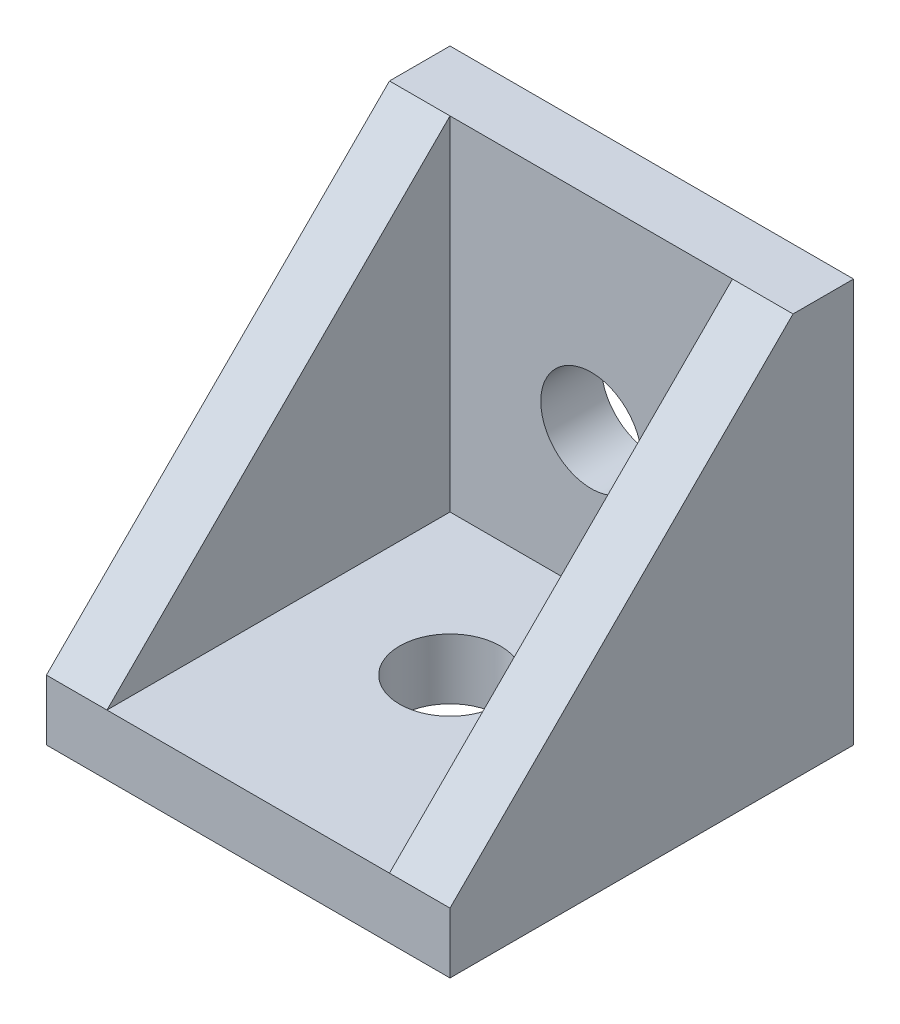
ISO-10303-21;
HEADER;
FILE_DESCRIPTION(('STEP AP214'),'2;1');
FILE_NAME('part.step','',(''),(''),'','','');
FILE_SCHEMA(('AUTOMOTIVE_DESIGN { 1 0 10303 214 1 1 1 1 }'));
ENDSEC;
DATA;
#1=APPLICATION_CONTEXT('core data for automotive mechanical design processes');
#2=APPLICATION_PROTOCOL_DEFINITION('international standard','automotive_design',2000,#1);
#3=PRODUCT_CONTEXT('',#1,'mechanical');
#4=PRODUCT('Part','Part','',(#3));
#5=PRODUCT_RELATED_PRODUCT_CATEGORY('part','',(#4));
#6=PRODUCT_DEFINITION_FORMATION('','',#4);
#7=PRODUCT_DEFINITION_CONTEXT('part definition',#1,'design');
#8=PRODUCT_DEFINITION('design','',#6,#7);
#9=PRODUCT_DEFINITION_SHAPE('','',#8);
#10=(LENGTH_UNIT() NAMED_UNIT(*) SI_UNIT(.MILLI.,.METRE.));
#11=(NAMED_UNIT(*) PLANE_ANGLE_UNIT() SI_UNIT($,.RADIAN.));
#12=(NAMED_UNIT(*) SI_UNIT($,.STERADIAN.) SOLID_ANGLE_UNIT());
#13=UNCERTAINTY_MEASURE_WITH_UNIT(LENGTH_MEASURE(1.E-05),#10,'distance_accuracy_value','');
#14=(GEOMETRIC_REPRESENTATION_CONTEXT(3) GLOBAL_UNCERTAINTY_ASSIGNED_CONTEXT((#13)) GLOBAL_UNIT_ASSIGNED_CONTEXT((#10,
#11,#12)) REPRESENTATION_CONTEXT('',''));
#15=CARTESIAN_POINT('',(0.,0.,0.));
#16=DIRECTION('',(0.,0.,1.));
#17=DIRECTION('',(1.,0.,0.));
#18=AXIS2_PLACEMENT_3D('',#15,#16,#17);
#19=CARTESIAN_POINT('',(-10.,0.,10.));
#20=DIRECTION('',(0.,1.,0.));
#21=DIRECTION('',(1.,0.,0.));
#22=AXIS2_PLACEMENT_3D('',#19,#20,#21);
#23=PLANE('',#22);
#24=CARTESIAN_POINT('',(-10.,0.,10.));
#25=DIRECTION('',(0.,-1.,0.));
#26=DIRECTION('',(1.,0.,0.));
#27=AXIS2_PLACEMENT_3D('',#24,#25,#26);
#28=CIRCLE('',#27,2.5);
#29=CARTESIAN_POINT('',(-12.5,0.,10.));
#30=VERTEX_POINT('',#29);
#31=EDGE_CURVE('E28',#30,#30,#28,.T.);
#32=ORIENTED_EDGE('',*,*,#31,.F.);
#33=EDGE_LOOP('',(#32));
#34=FACE_BOUND('',#33,.T.);
#35=DIRECTION('',(0.,0.,-1.));
#36=VECTOR('',#35,1.);
#37=CARTESIAN_POINT('',(0.,0.,20.));
#38=LINE('',#37,#36);
#39=CARTESIAN_POINT('',(0.,0.,20.));
#40=VERTEX_POINT('',#39);
#41=CARTESIAN_POINT('',(0.,0.,0.));
#42=VERTEX_POINT('',#41);
#43=EDGE_CURVE('E144',#40,#42,#38,.T.);
#44=ORIENTED_EDGE('',*,*,#43,.F.);
#45=DIRECTION('',(1.,0.,0.));
#46=VECTOR('',#45,1.);
#47=CARTESIAN_POINT('',(-20.,0.,20.));
#48=LINE('',#47,#46);
#49=CARTESIAN_POINT('',(-20.,0.,20.));
#50=VERTEX_POINT('',#49);
#51=EDGE_CURVE('E201',#50,#40,#48,.T.);
#52=ORIENTED_EDGE('',*,*,#51,.F.);
#53=DIRECTION('',(0.,0.,1.));
#54=VECTOR('',#53,1.);
#55=CARTESIAN_POINT('',(-20.,0.,0.));
#56=LINE('',#55,#54);
#57=CARTESIAN_POINT('',(-20.,0.,0.));
#58=VERTEX_POINT('',#57);
#59=EDGE_CURVE('E177',#58,#50,#56,.T.);
#60=ORIENTED_EDGE('',*,*,#59,.F.);
#61=DIRECTION('',(-1.,0.,0.));
#62=VECTOR('',#61,1.);
#63=CARTESIAN_POINT('',(0.,0.,0.));
#64=LINE('',#63,#62);
#65=EDGE_CURVE('E11',#42,#58,#64,.T.);
#66=ORIENTED_EDGE('',*,*,#65,.F.);
#67=EDGE_LOOP('',(#44,#52,#60,#66));
#68=FACE_BOUND('',#67,.T.);
#69=ADVANCED_FACE('F17',(#34,#68),#23,.F.);
#70=CARTESIAN_POINT('',(0.,0.,0.));
#71=DIRECTION('',(0.,0.,-1.));
#72=DIRECTION('',(0.,-1.,0.));
#73=AXIS2_PLACEMENT_3D('',#70,#71,#72);
#74=PLANE('',#73);
#75=CARTESIAN_POINT('',(-10.,10.,0.));
#76=DIRECTION('',(0.,0.,1.));
#77=DIRECTION('',(1.,0.,0.));
#78=AXIS2_PLACEMENT_3D('',#75,#76,#77);
#79=CIRCLE('',#78,2.5);
#80=CARTESIAN_POINT('',(-12.5,10.,0.));
#81=VERTEX_POINT('',#80);
#82=EDGE_CURVE('E249',#81,#81,#79,.T.);
#83=ORIENTED_EDGE('',*,*,#82,.T.);
#84=EDGE_LOOP('',(#83));
#85=FACE_BOUND('',#84,.T.);
#86=ORIENTED_EDGE('',*,*,#65,.T.);
#87=DIRECTION('',(0.,1.,0.));
#88=VECTOR('',#87,1.);
#89=CARTESIAN_POINT('',(-20.,0.,0.));
#90=LINE('',#89,#88);
#91=CARTESIAN_POINT('',(-20.,20.,0.));
#92=VERTEX_POINT('',#91);
#93=EDGE_CURVE('E154',#58,#92,#90,.T.);
#94=ORIENTED_EDGE('',*,*,#93,.T.);
#95=DIRECTION('',(-1.,0.,0.));
#96=VECTOR('',#95,1.);
#97=CARTESIAN_POINT('',(0.,20.,0.));
#98=LINE('',#97,#96);
#99=CARTESIAN_POINT('',(0.,20.,0.));
#100=VERTEX_POINT('',#99);
#101=EDGE_CURVE('E151',#100,#92,#98,.T.);
#102=ORIENTED_EDGE('',*,*,#101,.F.);
#103=DIRECTION('',(0.,1.,0.));
#104=VECTOR('',#103,1.);
#105=CARTESIAN_POINT('',(0.,0.,0.));
#106=LINE('',#105,#104);
#107=EDGE_CURVE('E136',#42,#100,#106,.T.);
#108=ORIENTED_EDGE('',*,*,#107,.F.);
#109=EDGE_LOOP('',(#86,#94,#102,#108));
#110=FACE_BOUND('',#109,.T.);
#111=ADVANCED_FACE('F152',(#85,#110),#74,.T.);
#112=CARTESIAN_POINT('',(-10.,0.,10.));
#113=DIRECTION('',(0.,1.,0.));
#114=DIRECTION('',(1.,0.,0.));
#115=AXIS2_PLACEMENT_3D('',#112,#113,#114);
#116=CYLINDRICAL_SURFACE('',#115,2.5);
#117=CARTESIAN_POINT('',(-10.,3.,10.));
#118=DIRECTION('',(0.,1.,0.));
#119=DIRECTION('',(1.,0.,0.));
#120=AXIS2_PLACEMENT_3D('',#117,#118,#119);
#121=CIRCLE('',#120,2.5);
#122=CARTESIAN_POINT('',(-7.5,3.,10.));
#123=VERTEX_POINT('',#122);
#124=CARTESIAN_POINT('',(-12.5,3.,10.));
#125=VERTEX_POINT('',#124);
#126=EDGE_CURVE('E193',#123,#125,#121,.T.);
#127=ORIENTED_EDGE('',*,*,#126,.T.);
#128=DIRECTION('',(0.,-1.,0.));
#129=VECTOR('',#128,1.);
#130=CARTESIAN_POINT('',(-12.5,0.,10.));
#131=LINE('',#130,#129);
#132=EDGE_CURVE('E235',#125,#30,#131,.T.);
#133=ORIENTED_EDGE('',*,*,#132,.T.);
#134=ORIENTED_EDGE('',*,*,#31,.T.);
#135=ORIENTED_EDGE('',*,*,#132,.F.);
#136=CARTESIAN_POINT('',(-10.,3.,10.));
#137=DIRECTION('',(0.,1.,0.));
#138=DIRECTION('',(1.,0.,0.));
#139=AXIS2_PLACEMENT_3D('',#136,#137,#138);
#140=CIRCLE('',#139,2.5);
#141=EDGE_CURVE('E204',#125,#123,#140,.T.);
#142=ORIENTED_EDGE('',*,*,#141,.T.);
#143=EDGE_LOOP('',(#127,#133,#134,#135,#142));
#144=FACE_BOUND('',#143,.T.);
#145=ADVANCED_FACE('F285',(#144),#116,.F.);
#146=CARTESIAN_POINT('',(-10.,10.,20.));
#147=DIRECTION('',(0.,0.,-1.));
#148=DIRECTION('',(1.,0.,0.));
#149=AXIS2_PLACEMENT_3D('',#146,#147,#148);
#150=CYLINDRICAL_SURFACE('',#149,2.5);
#151=CARTESIAN_POINT('',(-10.,10.,3.));
#152=DIRECTION('',(0.,0.,1.));
#153=DIRECTION('',(1.,0.,0.));
#154=AXIS2_PLACEMENT_3D('',#151,#152,#153);
#155=CIRCLE('',#154,2.5);
#156=CARTESIAN_POINT('',(-12.5,10.,3.));
#157=VERTEX_POINT('',#156);
#158=EDGE_CURVE('E21',#157,#157,#155,.T.);
#159=ORIENTED_EDGE('',*,*,#158,.T.);
#160=DIRECTION('',(0.,0.,-1.));
#161=VECTOR('',#160,1.);
#162=CARTESIAN_POINT('',(-12.5,10.,20.));
#163=LINE('',#162,#161);
#164=EDGE_CURVE('E203',#157,#81,#163,.T.);
#165=ORIENTED_EDGE('',*,*,#164,.T.);
#166=ORIENTED_EDGE('',*,*,#82,.F.);
#167=ORIENTED_EDGE('',*,*,#164,.F.);
#168=EDGE_LOOP('',(#159,#165,#166,#167));
#169=FACE_BOUND('',#168,.T.);
#170=ADVANCED_FACE('F19',(#169),#150,.F.);
#171=CARTESIAN_POINT('',(-20.,0.,20.));
#172=DIRECTION('',(0.,0.,1.));
#173=DIRECTION('',(1.,0.,0.));
#174=AXIS2_PLACEMENT_3D('',#171,#172,#173);
#175=PLANE('',#174);
#176=DIRECTION('',(-1.,0.,0.));
#177=VECTOR('',#176,1.);
#178=CARTESIAN_POINT('',(-20.,3.,20.));
#179=LINE('',#178,#177);
#180=CARTESIAN_POINT('',(-17.,3.,20.));
#181=VERTEX_POINT('',#180);
#182=CARTESIAN_POINT('',(-20.,3.,20.));
#183=VERTEX_POINT('',#182);
#184=EDGE_CURVE('E194',#181,#183,#179,.T.);
#185=ORIENTED_EDGE('',*,*,#184,.T.);
#186=DIRECTION('',(0.,1.,0.));
#187=VECTOR('',#186,1.);
#188=CARTESIAN_POINT('',(-20.,0.,20.));
#189=LINE('',#188,#187);
#190=EDGE_CURVE('E181',#50,#183,#189,.T.);
#191=ORIENTED_EDGE('',*,*,#190,.F.);
#192=ORIENTED_EDGE('',*,*,#51,.T.);
#193=DIRECTION('',(0.,1.,0.));
#194=VECTOR('',#193,1.);
#195=CARTESIAN_POINT('',(0.,0.,20.));
#196=LINE('',#195,#194);
#197=CARTESIAN_POINT('',(0.,3.,20.));
#198=VERTEX_POINT('',#197);
#199=EDGE_CURVE('E158',#40,#198,#196,.T.);
#200=ORIENTED_EDGE('',*,*,#199,.T.);
#201=DIRECTION('',(-1.,0.,0.));
#202=VECTOR('',#201,1.);
#203=CARTESIAN_POINT('',(-20.,3.,20.));
#204=LINE('',#203,#202);
#205=CARTESIAN_POINT('',(-3.,3.,20.));
#206=VERTEX_POINT('',#205);
#207=EDGE_CURVE('E175',#198,#206,#204,.T.);
#208=ORIENTED_EDGE('',*,*,#207,.T.);
#209=DIRECTION('',(-1.,0.,0.));
#210=VECTOR('',#209,1.);
#211=CARTESIAN_POINT('',(-15.,3.,20.));
#212=LINE('',#211,#210);
#213=EDGE_CURVE('E58',#206,#181,#212,.T.);
#214=ORIENTED_EDGE('',*,*,#213,.T.);
#215=EDGE_LOOP('',(#185,#191,#192,#200,#208,#214));
#216=FACE_BOUND('',#215,.T.);
#217=ADVANCED_FACE('F274',(#216),#175,.T.);
#218=CARTESIAN_POINT('',(-10.,3.,11.5));
#219=DIRECTION('',(0.,1.,0.));
#220=DIRECTION('',(1.,0.,0.));
#221=AXIS2_PLACEMENT_3D('',#218,#219,#220);
#222=PLANE('',#221);
#223=ORIENTED_EDGE('',*,*,#126,.F.);
#224=ORIENTED_EDGE('',*,*,#141,.F.);
#225=EDGE_LOOP('',(#223,#224));
#226=FACE_BOUND('',#225,.T.);
#227=ORIENTED_EDGE('',*,*,#213,.F.);
#228=DIRECTION('',(0.,0.,1.));
#229=VECTOR('',#228,1.);
#230=CARTESIAN_POINT('',(-3.,3.,20.));
#231=LINE('',#230,#229);
#232=CARTESIAN_POINT('',(-3.,3.,3.));
#233=VERTEX_POINT('',#232);
#234=EDGE_CURVE('E223',#233,#206,#231,.T.);
#235=ORIENTED_EDGE('',*,*,#234,.F.);
#236=DIRECTION('',(1.,0.,0.));
#237=VECTOR('',#236,1.);
#238=CARTESIAN_POINT('',(-3.,3.,3.));
#239=LINE('',#238,#237);
#240=CARTESIAN_POINT('',(-17.,3.,3.));
#241=VERTEX_POINT('',#240);
#242=EDGE_CURVE('E112',#241,#233,#239,.T.);
#243=ORIENTED_EDGE('',*,*,#242,.F.);
#244=DIRECTION('',(0.,0.,-1.));
#245=VECTOR('',#244,1.);
#246=CARTESIAN_POINT('',(-17.,3.,20.));
#247=LINE('',#246,#245);
#248=EDGE_CURVE('E219',#181,#241,#247,.T.);
#249=ORIENTED_EDGE('',*,*,#248,.F.);
#250=EDGE_LOOP('',(#227,#235,#243,#249));
#251=FACE_BOUND('',#250,.T.);
#252=ADVANCED_FACE('F265',(#226,#251),#222,.T.);
#253=CARTESIAN_POINT('',(-17.,20.,3.));
#254=DIRECTION('',(0.,0.,-1.));
#255=DIRECTION('',(0.,-1.,0.));
#256=AXIS2_PLACEMENT_3D('',#253,#254,#255);
#257=PLANE('',#256);
#258=ORIENTED_EDGE('',*,*,#158,.F.);
#259=EDGE_LOOP('',(#258));
#260=FACE_BOUND('',#259,.T.);
#261=DIRECTION('',(1.,0.,0.));
#262=VECTOR('',#261,1.);
#263=CARTESIAN_POINT('',(-13.5,20.,3.));
#264=LINE('',#263,#262);
#265=CARTESIAN_POINT('',(-17.,20.,3.));
#266=VERTEX_POINT('',#265);
#267=CARTESIAN_POINT('',(-3.,20.,3.));
#268=VERTEX_POINT('',#267);
#269=EDGE_CURVE('E74',#266,#268,#264,.T.);
#270=ORIENTED_EDGE('',*,*,#269,.F.);
#271=DIRECTION('',(0.,-1.,0.));
#272=VECTOR('',#271,1.);
#273=CARTESIAN_POINT('',(-17.,20.,3.));
#274=LINE('',#273,#272);
#275=EDGE_CURVE('E171',#266,#241,#274,.T.);
#276=ORIENTED_EDGE('',*,*,#275,.T.);
#277=ORIENTED_EDGE('',*,*,#242,.T.);
#278=DIRECTION('',(0.,-1.,0.));
#279=VECTOR('',#278,1.);
#280=CARTESIAN_POINT('',(-3.,20.,3.));
#281=LINE('',#280,#279);
#282=EDGE_CURVE('E147',#268,#233,#281,.T.);
#283=ORIENTED_EDGE('',*,*,#282,.F.);
#284=EDGE_LOOP('',(#270,#276,#277,#283));
#285=FACE_BOUND('',#284,.T.);
#286=ADVANCED_FACE('F262',(#260,#285),#257,.F.);
#287=CARTESIAN_POINT('',(-3.,20.,3.));
#288=DIRECTION('',(1.,0.,0.));
#289=DIRECTION('',(0.,1.,0.));
#290=AXIS2_PLACEMENT_3D('',#287,#288,#289);
#291=PLANE('',#290);
#292=DIRECTION('',(0.,0.707106781186548,-0.707106781186547));
#293=VECTOR('',#292,1.);
#294=CARTESIAN_POINT('',(-3.,11.5,11.5));
#295=LINE('',#294,#293);
#296=EDGE_CURVE('E184',#206,#268,#295,.T.);
#297=ORIENTED_EDGE('',*,*,#296,.T.);
#298=ORIENTED_EDGE('',*,*,#282,.T.);
#299=ORIENTED_EDGE('',*,*,#234,.T.);
#300=EDGE_LOOP('',(#297,#298,#299));
#301=FACE_BOUND('',#300,.T.);
#302=ADVANCED_FACE('F264',(#301),#291,.F.);
#303=CARTESIAN_POINT('',(0.,0.,20.));
#304=DIRECTION('',(1.,0.,0.));
#305=DIRECTION('',(0.,1.,0.));
#306=AXIS2_PLACEMENT_3D('',#303,#304,#305);
#307=PLANE('',#306);
#308=DIRECTION('',(0.,-0.707106781186548,0.707106781186547));
#309=VECTOR('',#308,1.);
#310=CARTESIAN_POINT('',(0.,2.25,20.75));
#311=LINE('',#310,#309);
#312=CARTESIAN_POINT('',(0.,20.,3.));
#313=VERTEX_POINT('',#312);
#314=EDGE_CURVE('E188',#313,#198,#311,.T.);
#315=ORIENTED_EDGE('',*,*,#314,.T.);
#316=ORIENTED_EDGE('',*,*,#199,.F.);
#317=ORIENTED_EDGE('',*,*,#43,.T.);
#318=ORIENTED_EDGE('',*,*,#107,.T.);
#319=DIRECTION('',(0.,0.,-1.));
#320=VECTOR('',#319,1.);
#321=CARTESIAN_POINT('',(0.,20.,20.));
#322=LINE('',#321,#320);
#323=EDGE_CURVE('E141',#313,#100,#322,.T.);
#324=ORIENTED_EDGE('',*,*,#323,.F.);
#325=EDGE_LOOP('',(#315,#316,#317,#318,#324));
#326=FACE_BOUND('',#325,.T.);
#327=ADVANCED_FACE('F139',(#326),#307,.T.);
#328=CARTESIAN_POINT('',(-10.,20.,10.));
#329=DIRECTION('',(0.,1.,0.));
#330=DIRECTION('',(1.,0.,0.));
#331=AXIS2_PLACEMENT_3D('',#328,#329,#330);
#332=PLANE('',#331);
#333=DIRECTION('',(1.,0.,0.));
#334=VECTOR('',#333,1.);
#335=CARTESIAN_POINT('',(-15.,20.,3.));
#336=LINE('',#335,#334);
#337=CARTESIAN_POINT('',(-20.,20.,3.));
#338=VERTEX_POINT('',#337);
#339=EDGE_CURVE('E228',#338,#266,#336,.T.);
#340=ORIENTED_EDGE('',*,*,#339,.T.);
#341=ORIENTED_EDGE('',*,*,#269,.T.);
#342=DIRECTION('',(1.,0.,0.));
#343=VECTOR('',#342,1.);
#344=CARTESIAN_POINT('',(-15.,20.,3.));
#345=LINE('',#344,#343);
#346=EDGE_CURVE('E163',#268,#313,#345,.T.);
#347=ORIENTED_EDGE('',*,*,#346,.T.);
#348=ORIENTED_EDGE('',*,*,#323,.T.);
#349=ORIENTED_EDGE('',*,*,#101,.T.);
#350=DIRECTION('',(0.,0.,1.));
#351=VECTOR('',#350,1.);
#352=CARTESIAN_POINT('',(-20.,20.,0.));
#353=LINE('',#352,#351);
#354=EDGE_CURVE('E197',#92,#338,#353,.T.);
#355=ORIENTED_EDGE('',*,*,#354,.T.);
#356=EDGE_LOOP('',(#340,#341,#347,#348,#349,#355));
#357=FACE_BOUND('',#356,.T.);
#358=ADVANCED_FACE('F161',(#357),#332,.T.);
#359=CARTESIAN_POINT('',(-17.,20.,20.));
#360=DIRECTION('',(-1.,0.,0.));
#361=DIRECTION('',(0.,0.,1.));
#362=AXIS2_PLACEMENT_3D('',#359,#360,#361);
#363=PLANE('',#362);
#364=DIRECTION('',(0.,-0.707106781186548,0.707106781186547));
#365=VECTOR('',#364,1.);
#366=CARTESIAN_POINT('',(-17.,7.25,15.75));
#367=LINE('',#366,#365);
#368=EDGE_CURVE('E224',#266,#181,#367,.T.);
#369=ORIENTED_EDGE('',*,*,#368,.T.);
#370=ORIENTED_EDGE('',*,*,#248,.T.);
#371=ORIENTED_EDGE('',*,*,#275,.F.);
#372=EDGE_LOOP('',(#369,#370,#371));
#373=FACE_BOUND('',#372,.T.);
#374=ADVANCED_FACE('F294',(#373),#363,.F.);
#375=CARTESIAN_POINT('',(-20.,0.,0.));
#376=DIRECTION('',(-1.,0.,0.));
#377=DIRECTION('',(0.,0.,1.));
#378=AXIS2_PLACEMENT_3D('',#375,#376,#377);
#379=PLANE('',#378);
#380=DIRECTION('',(0.,0.707106781186548,-0.707106781186547));
#381=VECTOR('',#380,1.);
#382=CARTESIAN_POINT('',(-20.,7.25,15.75));
#383=LINE('',#382,#381);
#384=EDGE_CURVE('E198',#183,#338,#383,.T.);
#385=ORIENTED_EDGE('',*,*,#384,.T.);
#386=ORIENTED_EDGE('',*,*,#354,.F.);
#387=ORIENTED_EDGE('',*,*,#93,.F.);
#388=ORIENTED_EDGE('',*,*,#59,.T.);
#389=ORIENTED_EDGE('',*,*,#190,.T.);
#390=EDGE_LOOP('',(#385,#386,#387,#388,#389));
#391=FACE_BOUND('',#390,.T.);
#392=ADVANCED_FACE('F291',(#391),#379,.T.);
#393=CARTESIAN_POINT('',(-20.,3.,20.));
#394=DIRECTION('',(0.,-0.707106781186547,-0.707106781186548));
#395=DIRECTION('',(0.,-0.707106781186548,0.707106781186547));
#396=AXIS2_PLACEMENT_3D('',#393,#394,#395);
#397=PLANE('',#396);
#398=ORIENTED_EDGE('',*,*,#368,.F.);
#399=ORIENTED_EDGE('',*,*,#339,.F.);
#400=ORIENTED_EDGE('',*,*,#384,.F.);
#401=ORIENTED_EDGE('',*,*,#184,.F.);
#402=EDGE_LOOP('',(#398,#399,#400,#401));
#403=FACE_BOUND('',#402,.T.);
#404=ADVANCED_FACE('F293',(#403),#397,.F.);
#405=CARTESIAN_POINT('',(-20.,3.,20.));
#406=DIRECTION('',(0.,-0.707106781186547,-0.707106781186548));
#407=DIRECTION('',(0.,-0.707106781186548,0.707106781186547));
#408=AXIS2_PLACEMENT_3D('',#405,#406,#407);
#409=PLANE('',#408);
#410=ORIENTED_EDGE('',*,*,#296,.F.);
#411=ORIENTED_EDGE('',*,*,#207,.F.);
#412=ORIENTED_EDGE('',*,*,#314,.F.);
#413=ORIENTED_EDGE('',*,*,#346,.F.);
#414=EDGE_LOOP('',(#410,#411,#412,#413));
#415=FACE_BOUND('',#414,.T.);
#416=ADVANCED_FACE('F296',(#415),#409,.F.);
#417=CLOSED_SHELL('',(#69,#111,#145,#170,#217,#252,#286,#302,#327,#358,#374,#392,#404,#416));
#418=MANIFOLD_SOLID_BREP('B1',#417);
#419=ADVANCED_BREP_SHAPE_REPRESENTATION('',(#18,#418),#14);
#420=SHAPE_DEFINITION_REPRESENTATION(#9,#419);
ENDSEC;
END-ISO-10303-21;
